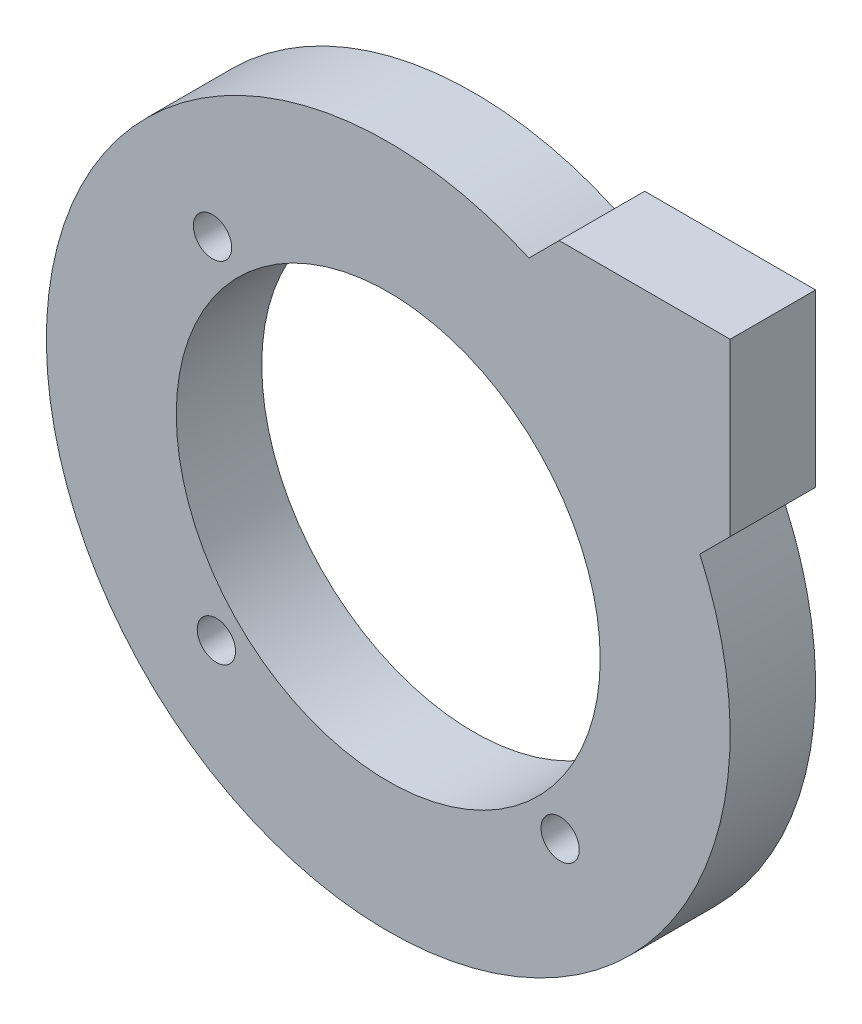
ISO-10303-21;
HEADER;
FILE_DESCRIPTION(('STEP AP214'),'2;1');
FILE_NAME('part.step','',(''),(''),'','','');
FILE_SCHEMA(('AUTOMOTIVE_DESIGN { 1 0 10303 214 1 1 1 1 }'));
ENDSEC;
DATA;
#1=APPLICATION_CONTEXT('core data for automotive mechanical design processes');
#2=APPLICATION_PROTOCOL_DEFINITION('international standard','automotive_design',2000,#1);
#3=PRODUCT_CONTEXT('',#1,'mechanical');
#4=PRODUCT('Part','Part','',(#3));
#5=PRODUCT_RELATED_PRODUCT_CATEGORY('part','',(#4));
#6=PRODUCT_DEFINITION_FORMATION('','',#4);
#7=PRODUCT_DEFINITION_CONTEXT('part definition',#1,'design');
#8=PRODUCT_DEFINITION('design','',#6,#7);
#9=PRODUCT_DEFINITION_SHAPE('','',#8);
#10=(LENGTH_UNIT() NAMED_UNIT(*) SI_UNIT(.MILLI.,.METRE.));
#11=(NAMED_UNIT(*) PLANE_ANGLE_UNIT() SI_UNIT($,.RADIAN.));
#12=(NAMED_UNIT(*) SI_UNIT($,.STERADIAN.) SOLID_ANGLE_UNIT());
#13=UNCERTAINTY_MEASURE_WITH_UNIT(LENGTH_MEASURE(1.E-05),#10,'distance_accuracy_value','');
#14=(GEOMETRIC_REPRESENTATION_CONTEXT(3) GLOBAL_UNCERTAINTY_ASSIGNED_CONTEXT((#13)) GLOBAL_UNIT_ASSIGNED_CONTEXT((#10,
#11,#12)) REPRESENTATION_CONTEXT('',''));
#15=CARTESIAN_POINT('',(0.,0.,0.));
#16=DIRECTION('',(0.,0.,1.));
#17=DIRECTION('',(1.,0.,0.));
#18=AXIS2_PLACEMENT_3D('',#15,#16,#17);
#19=CARTESIAN_POINT('',(0.,0.,6.35));
#20=DIRECTION('',(0.,0.,1.));
#21=DIRECTION('',(1.,0.,0.));
#22=AXIS2_PLACEMENT_3D('',#19,#20,#21);
#23=PLANE('',#22);
#24=CARTESIAN_POINT('',(12.7691023297534,-13.0565150194179,6.35));
#25=DIRECTION('',(0.,0.,1.));
#26=DIRECTION('',(1.,0.,0.));
#27=AXIS2_PLACEMENT_3D('',#24,#25,#26);
#28=CIRCLE('',#27,1.4224);
#29=CARTESIAN_POINT('',(14.1915023297534,-13.0565150194179,6.35));
#30=VERTEX_POINT('',#29);
#31=EDGE_CURVE('E166',#30,#30,#28,.T.);
#32=ORIENTED_EDGE('',*,*,#31,.F.);
#33=EDGE_LOOP('',(#32));
#34=FACE_BOUND('',#33,.T.);
#35=CARTESIAN_POINT('',(-13.0565150194179,12.7691023297534,6.35));
#36=DIRECTION('',(0.,0.,-1.));
#37=DIRECTION('',(-1.,0.,0.));
#38=AXIS2_PLACEMENT_3D('',#35,#36,#37);
#39=CIRCLE('',#38,1.4224);
#40=CARTESIAN_POINT('',(-14.4789150194179,12.7691023297534,6.35));
#41=VERTEX_POINT('',#40);
#42=EDGE_CURVE('E175',#41,#41,#39,.T.);
#43=ORIENTED_EDGE('',*,*,#42,.T.);
#44=EDGE_LOOP('',(#43));
#45=FACE_BOUND('',#44,.T.);
#46=CARTESIAN_POINT('',(0.,0.,6.35));
#47=DIRECTION('',(0.,0.,1.));
#48=DIRECTION('',(1.,0.,0.));
#49=AXIS2_PLACEMENT_3D('',#46,#47,#48);
#50=CIRCLE('',#49,25.4);
#51=CARTESIAN_POINT('',(10.4505208252602,23.1505208252601,6.35));
#52=VERTEX_POINT('',#51);
#53=CARTESIAN_POINT('',(23.1505208252602,10.4505208252601,6.35));
#54=VERTEX_POINT('',#53);
#55=EDGE_CURVE('E117',#52,#54,#50,.T.);
#56=ORIENTED_EDGE('',*,*,#55,.T.);
#57=DIRECTION('',(0.707106781186547,0.707106781186548,0.));
#58=VECTOR('',#57,1.);
#59=CARTESIAN_POINT('',(23.1505208252602,10.4505208252601,6.35));
#60=LINE('',#59,#58);
#61=CARTESIAN_POINT('',(25.4,12.7,6.35));
#62=VERTEX_POINT('',#61);
#63=EDGE_CURVE('E84',#54,#62,#60,.T.);
#64=ORIENTED_EDGE('',*,*,#63,.T.);
#65=DIRECTION('',(0.,1.,0.));
#66=VECTOR('',#65,1.);
#67=CARTESIAN_POINT('',(25.4,25.4,6.35));
#68=LINE('',#67,#66);
#69=CARTESIAN_POINT('',(25.4,25.4,6.35));
#70=VERTEX_POINT('',#69);
#71=EDGE_CURVE('E88',#62,#70,#68,.T.);
#72=ORIENTED_EDGE('',*,*,#71,.T.);
#73=DIRECTION('',(-1.,0.,0.));
#74=VECTOR('',#73,1.);
#75=CARTESIAN_POINT('',(12.7,25.4,6.35));
#76=LINE('',#75,#74);
#77=CARTESIAN_POINT('',(12.7,25.4,6.35));
#78=VERTEX_POINT('',#77);
#79=EDGE_CURVE('E92',#70,#78,#76,.T.);
#80=ORIENTED_EDGE('',*,*,#79,.T.);
#81=DIRECTION('',(-0.707106781186547,-0.707106781186548,0.));
#82=VECTOR('',#81,1.);
#83=CARTESIAN_POINT('',(10.4505208252602,23.1505208252601,6.35));
#84=LINE('',#83,#82);
#85=EDGE_CURVE('E50',#78,#52,#84,.T.);
#86=ORIENTED_EDGE('',*,*,#85,.T.);
#87=EDGE_LOOP('',(#56,#64,#72,#80,#86));
#88=FACE_BOUND('',#87,.T.);
#89=CARTESIAN_POINT('',(0.,0.,6.35));
#90=DIRECTION('',(0.,0.,1.));
#91=DIRECTION('',(1.,0.,0.));
#92=AXIS2_PLACEMENT_3D('',#89,#90,#91);
#93=CIRCLE('',#92,15.748);
#94=CARTESIAN_POINT('',(15.748,0.,6.35));
#95=VERTEX_POINT('',#94);
#96=EDGE_CURVE('E112',#95,#95,#93,.T.);
#97=ORIENTED_EDGE('',*,*,#96,.F.);
#98=EDGE_LOOP('',(#97));
#99=FACE_BOUND('',#98,.T.);
#100=CARTESIAN_POINT('',(-12.7691023297531,-13.0565150194182,6.35));
#101=DIRECTION('',(0.,0.,-1.));
#102=DIRECTION('',(-1.,0.,0.));
#103=AXIS2_PLACEMENT_3D('',#100,#101,#102);
#104=CIRCLE('',#103,1.4224);
#105=CARTESIAN_POINT('',(-14.1915023297531,-13.0565150194182,6.35));
#106=VERTEX_POINT('',#105);
#107=EDGE_CURVE('E170',#106,#106,#104,.T.);
#108=ORIENTED_EDGE('',*,*,#107,.T.);
#109=EDGE_LOOP('',(#108));
#110=FACE_BOUND('',#109,.T.);
#111=ADVANCED_FACE('F33',(#34,#45,#88,#99,#110),#23,.T.);
#112=CARTESIAN_POINT('',(0.,0.,0.));
#113=DIRECTION('',(0.,0.,1.));
#114=DIRECTION('',(1.,0.,0.));
#115=AXIS2_PLACEMENT_3D('',#112,#113,#114);
#116=PLANE('',#115);
#117=CARTESIAN_POINT('',(12.7691023297534,-13.0565150194179,0.));
#118=DIRECTION('',(0.,0.,1.));
#119=DIRECTION('',(1.,0.,0.));
#120=AXIS2_PLACEMENT_3D('',#117,#118,#119);
#121=CIRCLE('',#120,1.4224);
#122=CARTESIAN_POINT('',(14.1915023297534,-13.0565150194179,0.));
#123=VERTEX_POINT('',#122);
#124=EDGE_CURVE('E164',#123,#123,#121,.T.);
#125=ORIENTED_EDGE('',*,*,#124,.T.);
#126=EDGE_LOOP('',(#125));
#127=FACE_BOUND('',#126,.T.);
#128=CARTESIAN_POINT('',(-13.0565150194179,12.7691023297534,0.));
#129=DIRECTION('',(0.,0.,-1.));
#130=DIRECTION('',(-1.,0.,0.));
#131=AXIS2_PLACEMENT_3D('',#128,#129,#130);
#132=CIRCLE('',#131,1.4224);
#133=CARTESIAN_POINT('',(-14.4789150194179,12.7691023297534,0.));
#134=VERTEX_POINT('',#133);
#135=EDGE_CURVE('E177',#134,#134,#132,.T.);
#136=ORIENTED_EDGE('',*,*,#135,.F.);
#137=EDGE_LOOP('',(#136));
#138=FACE_BOUND('',#137,.T.);
#139=CARTESIAN_POINT('',(0.,0.,0.));
#140=DIRECTION('',(0.,0.,1.));
#141=DIRECTION('',(1.,0.,0.));
#142=AXIS2_PLACEMENT_3D('',#139,#140,#141);
#143=CIRCLE('',#142,25.4);
#144=CARTESIAN_POINT('',(10.4505208252602,23.1505208252601,0.));
#145=VERTEX_POINT('',#144);
#146=CARTESIAN_POINT('',(23.1505208252602,10.4505208252601,0.));
#147=VERTEX_POINT('',#146);
#148=EDGE_CURVE('E108',#145,#147,#143,.T.);
#149=ORIENTED_EDGE('',*,*,#148,.F.);
#150=DIRECTION('',(-0.707106781186547,-0.707106781186548,0.));
#151=VECTOR('',#150,1.);
#152=CARTESIAN_POINT('',(10.4505208252602,23.1505208252601,0.));
#153=LINE('',#152,#151);
#154=CARTESIAN_POINT('',(12.7,25.4,0.));
#155=VERTEX_POINT('',#154);
#156=EDGE_CURVE('E76',#155,#145,#153,.T.);
#157=ORIENTED_EDGE('',*,*,#156,.F.);
#158=DIRECTION('',(-1.,0.,0.));
#159=VECTOR('',#158,1.);
#160=CARTESIAN_POINT('',(12.7,25.4,0.));
#161=LINE('',#160,#159);
#162=CARTESIAN_POINT('',(25.4,25.4,0.));
#163=VERTEX_POINT('',#162);
#164=EDGE_CURVE('E70',#163,#155,#161,.T.);
#165=ORIENTED_EDGE('',*,*,#164,.F.);
#166=DIRECTION('',(0.,1.,0.));
#167=VECTOR('',#166,1.);
#168=CARTESIAN_POINT('',(25.4,25.4,0.));
#169=LINE('',#168,#167);
#170=CARTESIAN_POINT('',(25.4,12.7,0.));
#171=VERTEX_POINT('',#170);
#172=EDGE_CURVE('E99',#171,#163,#169,.T.);
#173=ORIENTED_EDGE('',*,*,#172,.F.);
#174=DIRECTION('',(0.707106781186547,0.707106781186548,0.));
#175=VECTOR('',#174,1.);
#176=CARTESIAN_POINT('',(23.1505208252602,10.4505208252601,0.));
#177=LINE('',#176,#175);
#178=EDGE_CURVE('E111',#147,#171,#177,.T.);
#179=ORIENTED_EDGE('',*,*,#178,.F.);
#180=EDGE_LOOP('',(#149,#157,#165,#173,#179));
#181=FACE_BOUND('',#180,.T.);
#182=CARTESIAN_POINT('',(0.,0.,0.));
#183=DIRECTION('',(0.,0.,1.));
#184=DIRECTION('',(1.,0.,0.));
#185=AXIS2_PLACEMENT_3D('',#182,#183,#184);
#186=CIRCLE('',#185,15.748);
#187=CARTESIAN_POINT('',(15.748,0.,0.));
#188=VERTEX_POINT('',#187);
#189=EDGE_CURVE('E180',#188,#188,#186,.T.);
#190=ORIENTED_EDGE('',*,*,#189,.T.);
#191=EDGE_LOOP('',(#190));
#192=FACE_BOUND('',#191,.T.);
#193=CARTESIAN_POINT('',(-12.7691023297531,-13.0565150194182,0.));
#194=DIRECTION('',(0.,0.,-1.));
#195=DIRECTION('',(-1.,0.,0.));
#196=AXIS2_PLACEMENT_3D('',#193,#194,#195);
#197=CIRCLE('',#196,1.4224);
#198=CARTESIAN_POINT('',(-14.1915023297531,-13.0565150194182,0.));
#199=VERTEX_POINT('',#198);
#200=EDGE_CURVE('E167',#199,#199,#197,.T.);
#201=ORIENTED_EDGE('',*,*,#200,.F.);
#202=EDGE_LOOP('',(#201));
#203=FACE_BOUND('',#202,.T.);
#204=ADVANCED_FACE('F121',(#127,#138,#181,#192,#203),#116,.F.);
#205=CARTESIAN_POINT('',(0.,0.,6.35));
#206=DIRECTION('',(0.,0.,-1.));
#207=DIRECTION('',(-1.,0.,0.));
#208=AXIS2_PLACEMENT_3D('',#205,#206,#207);
#209=CYLINDRICAL_SURFACE('',#208,25.4);
#210=ORIENTED_EDGE('',*,*,#148,.T.);
#211=DIRECTION('',(0.,0.,-1.));
#212=VECTOR('',#211,1.);
#213=CARTESIAN_POINT('',(23.1505208252602,10.4505208252601,6.35));
#214=LINE('',#213,#212);
#215=EDGE_CURVE('E11',#54,#147,#214,.T.);
#216=ORIENTED_EDGE('',*,*,#215,.F.);
#217=ORIENTED_EDGE('',*,*,#55,.F.);
#218=DIRECTION('',(0.,0.,-1.));
#219=VECTOR('',#218,1.);
#220=CARTESIAN_POINT('',(10.4505208252602,23.1505208252601,6.35));
#221=LINE('',#220,#219);
#222=EDGE_CURVE('E104',#52,#145,#221,.T.);
#223=ORIENTED_EDGE('',*,*,#222,.T.);
#224=EDGE_LOOP('',(#210,#216,#217,#223));
#225=FACE_BOUND('',#224,.T.);
#226=ADVANCED_FACE('F35',(#225),#209,.T.);
#227=CARTESIAN_POINT('',(23.1505208252602,10.4505208252601,6.35));
#228=DIRECTION('',(-0.707106781186548,0.707106781186547,0.));
#229=DIRECTION('',(-0.707106781186547,-0.707106781186548,0.));
#230=AXIS2_PLACEMENT_3D('',#227,#228,#229);
#231=PLANE('',#230);
#232=ORIENTED_EDGE('',*,*,#178,.T.);
#233=DIRECTION('',(0.,0.,-1.));
#234=VECTOR('',#233,1.);
#235=CARTESIAN_POINT('',(25.4,12.7,6.35));
#236=LINE('',#235,#234);
#237=EDGE_CURVE('E42',#62,#171,#236,.T.);
#238=ORIENTED_EDGE('',*,*,#237,.F.);
#239=ORIENTED_EDGE('',*,*,#63,.F.);
#240=ORIENTED_EDGE('',*,*,#215,.T.);
#241=EDGE_LOOP('',(#232,#238,#239,#240));
#242=FACE_BOUND('',#241,.T.);
#243=ADVANCED_FACE('F232',(#242),#231,.F.);
#244=CARTESIAN_POINT('',(25.4,25.4,6.35));
#245=DIRECTION('',(-1.,0.,0.));
#246=DIRECTION('',(0.,0.,1.));
#247=AXIS2_PLACEMENT_3D('',#244,#245,#246);
#248=PLANE('',#247);
#249=ORIENTED_EDGE('',*,*,#172,.T.);
#250=DIRECTION('',(0.,0.,-1.));
#251=VECTOR('',#250,1.);
#252=CARTESIAN_POINT('',(25.4,25.4,6.35));
#253=LINE('',#252,#251);
#254=EDGE_CURVE('E96',#70,#163,#253,.T.);
#255=ORIENTED_EDGE('',*,*,#254,.F.);
#256=ORIENTED_EDGE('',*,*,#71,.F.);
#257=ORIENTED_EDGE('',*,*,#237,.T.);
#258=EDGE_LOOP('',(#249,#255,#256,#257));
#259=FACE_BOUND('',#258,.T.);
#260=ADVANCED_FACE('F97',(#259),#248,.F.);
#261=CARTESIAN_POINT('',(12.7,25.4,6.35));
#262=DIRECTION('',(0.,-1.,0.));
#263=DIRECTION('',(1.,0.,0.));
#264=AXIS2_PLACEMENT_3D('',#261,#262,#263);
#265=PLANE('',#264);
#266=ORIENTED_EDGE('',*,*,#164,.T.);
#267=DIRECTION('',(0.,0.,-1.));
#268=VECTOR('',#267,1.);
#269=CARTESIAN_POINT('',(12.7,25.4,6.35));
#270=LINE('',#269,#268);
#271=EDGE_CURVE('E100',#78,#155,#270,.T.);
#272=ORIENTED_EDGE('',*,*,#271,.F.);
#273=ORIENTED_EDGE('',*,*,#79,.F.);
#274=ORIENTED_EDGE('',*,*,#254,.T.);
#275=EDGE_LOOP('',(#266,#272,#273,#274));
#276=FACE_BOUND('',#275,.T.);
#277=ADVANCED_FACE('F102',(#276),#265,.F.);
#278=CARTESIAN_POINT('',(10.4505208252602,23.1505208252601,6.35));
#279=DIRECTION('',(0.707106781186548,-0.707106781186547,0.));
#280=DIRECTION('',(0.707106781186547,0.707106781186548,0.));
#281=AXIS2_PLACEMENT_3D('',#278,#279,#280);
#282=PLANE('',#281);
#283=ORIENTED_EDGE('',*,*,#156,.T.);
#284=ORIENTED_EDGE('',*,*,#222,.F.);
#285=ORIENTED_EDGE('',*,*,#85,.F.);
#286=ORIENTED_EDGE('',*,*,#271,.T.);
#287=EDGE_LOOP('',(#283,#284,#285,#286));
#288=FACE_BOUND('',#287,.T.);
#289=ADVANCED_FACE('F126',(#288),#282,.F.);
#290=CARTESIAN_POINT('',(0.,0.,6.35));
#291=DIRECTION('',(0.,0.,-1.));
#292=DIRECTION('',(-1.,0.,0.));
#293=AXIS2_PLACEMENT_3D('',#290,#291,#292);
#294=CYLINDRICAL_SURFACE('',#293,15.748);
#295=ORIENTED_EDGE('',*,*,#96,.T.);
#296=EDGE_LOOP('',(#295));
#297=FACE_BOUND('',#296,.T.);
#298=ORIENTED_EDGE('',*,*,#189,.F.);
#299=EDGE_LOOP('',(#298));
#300=FACE_BOUND('',#299,.T.);
#301=ADVANCED_FACE('F128',(#297,#300),#294,.F.);
#302=CARTESIAN_POINT('',(-13.0565150194179,12.7691023297534,0.));
#303=DIRECTION('',(0.,0.,1.));
#304=DIRECTION('',(1.,0.,0.));
#305=AXIS2_PLACEMENT_3D('',#302,#303,#304);
#306=CYLINDRICAL_SURFACE('',#305,1.4224);
#307=ORIENTED_EDGE('',*,*,#135,.T.);
#308=EDGE_LOOP('',(#307));
#309=FACE_BOUND('',#308,.T.);
#310=ORIENTED_EDGE('',*,*,#42,.F.);
#311=EDGE_LOOP('',(#310));
#312=FACE_BOUND('',#311,.T.);
#313=ADVANCED_FACE('F134',(#309,#312),#306,.F.);
#314=CARTESIAN_POINT('',(-12.7691023297531,-13.0565150194182,0.));
#315=DIRECTION('',(0.,0.,1.));
#316=DIRECTION('',(1.,0.,0.));
#317=AXIS2_PLACEMENT_3D('',#314,#315,#316);
#318=CYLINDRICAL_SURFACE('',#317,1.4224);
#319=ORIENTED_EDGE('',*,*,#200,.T.);
#320=EDGE_LOOP('',(#319));
#321=FACE_BOUND('',#320,.T.);
#322=ORIENTED_EDGE('',*,*,#107,.F.);
#323=EDGE_LOOP('',(#322));
#324=FACE_BOUND('',#323,.T.);
#325=ADVANCED_FACE('F151',(#321,#324),#318,.F.);
#326=CARTESIAN_POINT('',(12.7691023297534,-13.0565150194179,0.));
#327=DIRECTION('',(0.,0.,1.));
#328=DIRECTION('',(1.,0.,0.));
#329=AXIS2_PLACEMENT_3D('',#326,#327,#328);
#330=CYLINDRICAL_SURFACE('',#329,1.4224);
#331=ORIENTED_EDGE('',*,*,#124,.F.);
#332=EDGE_LOOP('',(#331));
#333=FACE_BOUND('',#332,.T.);
#334=ORIENTED_EDGE('',*,*,#31,.T.);
#335=EDGE_LOOP('',(#334));
#336=FACE_BOUND('',#335,.T.);
#337=ADVANCED_FACE('F155',(#333,#336),#330,.F.);
#338=CLOSED_SHELL('',(#111,#204,#226,#243,#260,#277,#289,#301,#313,#325,#337));
#339=MANIFOLD_SOLID_BREP('B2',#338);
#340=ADVANCED_BREP_SHAPE_REPRESENTATION('',(#18,#339),#14);
#341=SHAPE_DEFINITION_REPRESENTATION(#9,#340);
ENDSEC;
END-ISO-10303-21;
